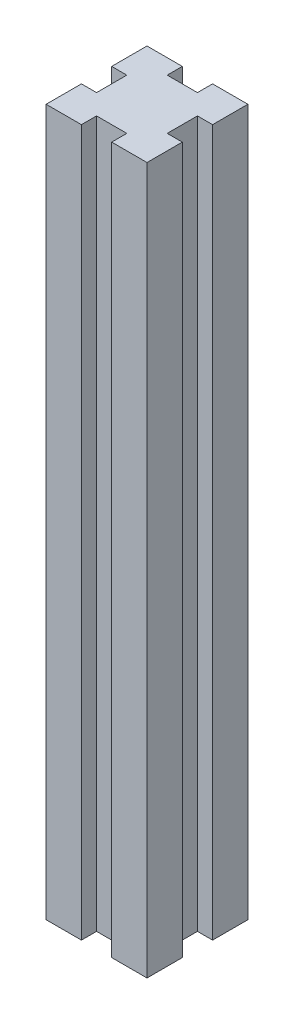
ISO-10303-21;
HEADER;
FILE_DESCRIPTION(('STEP AP214'),'2;1');
FILE_NAME('part.step','',(''),(''),'','','');
FILE_SCHEMA(('AUTOMOTIVE_DESIGN { 1 0 10303 214 1 1 1 1 }'));
ENDSEC;
DATA;
#1=APPLICATION_CONTEXT('core data for automotive mechanical design processes');
#2=APPLICATION_PROTOCOL_DEFINITION('international standard','automotive_design',2000,#1);
#3=PRODUCT_CONTEXT('',#1,'mechanical');
#4=PRODUCT('Part','Part','',(#3));
#5=PRODUCT_RELATED_PRODUCT_CATEGORY('part','',(#4));
#6=PRODUCT_DEFINITION_FORMATION('','',#4);
#7=PRODUCT_DEFINITION_CONTEXT('part definition',#1,'design');
#8=PRODUCT_DEFINITION('design','',#6,#7);
#9=PRODUCT_DEFINITION_SHAPE('','',#8);
#10=(LENGTH_UNIT() NAMED_UNIT(*) SI_UNIT(.MILLI.,.METRE.));
#11=(NAMED_UNIT(*) PLANE_ANGLE_UNIT() SI_UNIT($,.RADIAN.));
#12=(NAMED_UNIT(*) SI_UNIT($,.STERADIAN.) SOLID_ANGLE_UNIT());
#13=UNCERTAINTY_MEASURE_WITH_UNIT(LENGTH_MEASURE(1.E-05),#10,'distance_accuracy_value','');
#14=(GEOMETRIC_REPRESENTATION_CONTEXT(3) GLOBAL_UNCERTAINTY_ASSIGNED_CONTEXT((#13)) GLOBAL_UNIT_ASSIGNED_CONTEXT((#10,
#11,#12)) REPRESENTATION_CONTEXT('',''));
#15=CARTESIAN_POINT('',(0.,0.,0.));
#16=DIRECTION('',(0.,0.,1.));
#17=DIRECTION('',(1.,0.,0.));
#18=AXIS2_PLACEMENT_3D('',#15,#16,#17);
#19=CARTESIAN_POINT('',(-10.,140.,-10.));
#20=DIRECTION('',(1.,0.,0.));
#21=DIRECTION('',(0.,0.,-1.));
#22=AXIS2_PLACEMENT_3D('',#19,#20,#21);
#23=PLANE('',#22);
#24=DIRECTION('',(0.,0.,1.));
#25=VECTOR('',#24,1.);
#26=CARTESIAN_POINT('',(-10.,0.,-10.));
#27=LINE('',#26,#25);
#28=CARTESIAN_POINT('',(-10.,0.,-10.));
#29=VERTEX_POINT('',#28);
#30=CARTESIAN_POINT('',(-10.,0.,-3.));
#31=VERTEX_POINT('',#30);
#32=EDGE_CURVE('E201',#29,#31,#27,.T.);
#33=ORIENTED_EDGE('',*,*,#32,.T.);
#34=DIRECTION('',(0.,-1.,0.));
#35=VECTOR('',#34,1.);
#36=CARTESIAN_POINT('',(-10.,140.,-3.));
#37=LINE('',#36,#35);
#38=CARTESIAN_POINT('',(-10.,140.,-3.));
#39=VERTEX_POINT('',#38);
#40=EDGE_CURVE('E11',#39,#31,#37,.T.);
#41=ORIENTED_EDGE('',*,*,#40,.F.);
#42=DIRECTION('',(0.,0.,1.));
#43=VECTOR('',#42,1.);
#44=CARTESIAN_POINT('',(-10.,140.,-10.));
#45=LINE('',#44,#43);
#46=CARTESIAN_POINT('',(-10.,140.,-10.));
#47=VERTEX_POINT('',#46);
#48=EDGE_CURVE('E239',#47,#39,#45,.T.);
#49=ORIENTED_EDGE('',*,*,#48,.F.);
#50=DIRECTION('',(0.,-1.,0.));
#51=VECTOR('',#50,1.);
#52=CARTESIAN_POINT('',(-10.,140.,-10.));
#53=LINE('',#52,#51);
#54=EDGE_CURVE('E197',#47,#29,#53,.T.);
#55=ORIENTED_EDGE('',*,*,#54,.T.);
#56=EDGE_LOOP('',(#33,#41,#49,#55));
#57=FACE_BOUND('',#56,.T.);
#58=ADVANCED_FACE('F33',(#57),#23,.F.);
#59=CARTESIAN_POINT('',(-10.,140.,-3.));
#60=DIRECTION('',(0.,0.,-1.));
#61=DIRECTION('',(-1.,0.,0.));
#62=AXIS2_PLACEMENT_3D('',#59,#60,#61);
#63=PLANE('',#62);
#64=DIRECTION('',(1.,0.,0.));
#65=VECTOR('',#64,1.);
#66=CARTESIAN_POINT('',(-10.,0.,-3.));
#67=LINE('',#66,#65);
#68=CARTESIAN_POINT('',(-7.,0.,-3.));
#69=VERTEX_POINT('',#68);
#70=EDGE_CURVE('E204',#31,#69,#67,.T.);
#71=ORIENTED_EDGE('',*,*,#70,.T.);
#72=DIRECTION('',(0.,-1.,0.));
#73=VECTOR('',#72,1.);
#74=CARTESIAN_POINT('',(-7.,140.,-3.));
#75=LINE('',#74,#73);
#76=CARTESIAN_POINT('',(-7.,140.,-3.));
#77=VERTEX_POINT('',#76);
#78=EDGE_CURVE('E41',#77,#69,#75,.T.);
#79=ORIENTED_EDGE('',*,*,#78,.F.);
#80=DIRECTION('',(1.,0.,0.));
#81=VECTOR('',#80,1.);
#82=CARTESIAN_POINT('',(-10.,140.,-3.));
#83=LINE('',#82,#81);
#84=EDGE_CURVE('E128',#39,#77,#83,.T.);
#85=ORIENTED_EDGE('',*,*,#84,.F.);
#86=ORIENTED_EDGE('',*,*,#40,.T.);
#87=EDGE_LOOP('',(#71,#79,#85,#86));
#88=FACE_BOUND('',#87,.T.);
#89=ADVANCED_FACE('F357',(#88),#63,.F.);
#90=CARTESIAN_POINT('',(-7.,140.,3.));
#91=DIRECTION('',(1.,0.,0.));
#92=DIRECTION('',(0.,0.,-1.));
#93=AXIS2_PLACEMENT_3D('',#90,#91,#92);
#94=PLANE('',#93);
#95=DIRECTION('',(0.,0.,1.));
#96=VECTOR('',#95,1.);
#97=CARTESIAN_POINT('',(-7.,0.,3.));
#98=LINE('',#97,#96);
#99=CARTESIAN_POINT('',(-7.,0.,3.));
#100=VERTEX_POINT('',#99);
#101=EDGE_CURVE('E206',#69,#100,#98,.T.);
#102=ORIENTED_EDGE('',*,*,#101,.T.);
#103=DIRECTION('',(0.,-1.,0.));
#104=VECTOR('',#103,1.);
#105=CARTESIAN_POINT('',(-7.,140.,3.));
#106=LINE('',#105,#104);
#107=CARTESIAN_POINT('',(-7.,140.,3.));
#108=VERTEX_POINT('',#107);
#109=EDGE_CURVE('E282',#108,#100,#106,.T.);
#110=ORIENTED_EDGE('',*,*,#109,.F.);
#111=DIRECTION('',(0.,0.,1.));
#112=VECTOR('',#111,1.);
#113=CARTESIAN_POINT('',(-7.,140.,3.));
#114=LINE('',#113,#112);
#115=EDGE_CURVE('E290',#77,#108,#114,.T.);
#116=ORIENTED_EDGE('',*,*,#115,.F.);
#117=ORIENTED_EDGE('',*,*,#78,.T.);
#118=EDGE_LOOP('',(#102,#110,#116,#117));
#119=FACE_BOUND('',#118,.T.);
#120=ADVANCED_FACE('F288',(#119),#94,.F.);
#121=CARTESIAN_POINT('',(-10.,140.,3.));
#122=DIRECTION('',(0.,0.,1.));
#123=DIRECTION('',(1.,0.,0.));
#124=AXIS2_PLACEMENT_3D('',#121,#122,#123);
#125=PLANE('',#124);
#126=DIRECTION('',(-1.,0.,0.));
#127=VECTOR('',#126,1.);
#128=CARTESIAN_POINT('',(-10.,0.,3.));
#129=LINE('',#128,#127);
#130=CARTESIAN_POINT('',(-10.,0.,3.));
#131=VERTEX_POINT('',#130);
#132=EDGE_CURVE('E208',#100,#131,#129,.T.);
#133=ORIENTED_EDGE('',*,*,#132,.T.);
#134=DIRECTION('',(0.,-1.,0.));
#135=VECTOR('',#134,1.);
#136=CARTESIAN_POINT('',(-10.,140.,3.));
#137=LINE('',#136,#135);
#138=CARTESIAN_POINT('',(-10.,140.,3.));
#139=VERTEX_POINT('',#138);
#140=EDGE_CURVE('E279',#139,#131,#137,.T.);
#141=ORIENTED_EDGE('',*,*,#140,.F.);
#142=DIRECTION('',(-1.,0.,0.));
#143=VECTOR('',#142,1.);
#144=CARTESIAN_POINT('',(-10.,140.,3.));
#145=LINE('',#144,#143);
#146=EDGE_CURVE('E308',#108,#139,#145,.T.);
#147=ORIENTED_EDGE('',*,*,#146,.F.);
#148=ORIENTED_EDGE('',*,*,#109,.T.);
#149=EDGE_LOOP('',(#133,#141,#147,#148));
#150=FACE_BOUND('',#149,.T.);
#151=ADVANCED_FACE('F299',(#150),#125,.F.);
#152=CARTESIAN_POINT('',(-10.,140.,3.));
#153=DIRECTION('',(1.,0.,0.));
#154=DIRECTION('',(0.,0.,-1.));
#155=AXIS2_PLACEMENT_3D('',#152,#153,#154);
#156=PLANE('',#155);
#157=DIRECTION('',(0.,0.,1.));
#158=VECTOR('',#157,1.);
#159=CARTESIAN_POINT('',(-10.,0.,3.));
#160=LINE('',#159,#158);
#161=CARTESIAN_POINT('',(-10.,0.,10.));
#162=VERTEX_POINT('',#161);
#163=EDGE_CURVE('E210',#131,#162,#160,.T.);
#164=ORIENTED_EDGE('',*,*,#163,.T.);
#165=DIRECTION('',(0.,-1.,0.));
#166=VECTOR('',#165,1.);
#167=CARTESIAN_POINT('',(-10.,140.,10.));
#168=LINE('',#167,#166);
#169=CARTESIAN_POINT('',(-10.,140.,10.));
#170=VERTEX_POINT('',#169);
#171=EDGE_CURVE('E276',#170,#162,#168,.T.);
#172=ORIENTED_EDGE('',*,*,#171,.F.);
#173=DIRECTION('',(0.,0.,1.));
#174=VECTOR('',#173,1.);
#175=CARTESIAN_POINT('',(-10.,140.,3.));
#176=LINE('',#175,#174);
#177=EDGE_CURVE('E305',#139,#170,#176,.T.);
#178=ORIENTED_EDGE('',*,*,#177,.F.);
#179=ORIENTED_EDGE('',*,*,#140,.T.);
#180=EDGE_LOOP('',(#164,#172,#178,#179));
#181=FACE_BOUND('',#180,.T.);
#182=ADVANCED_FACE('F303',(#181),#156,.F.);
#183=CARTESIAN_POINT('',(-10.,140.,10.));
#184=DIRECTION('',(0.,0.,-1.));
#185=DIRECTION('',(-1.,0.,0.));
#186=AXIS2_PLACEMENT_3D('',#183,#184,#185);
#187=PLANE('',#186);
#188=DIRECTION('',(1.,0.,0.));
#189=VECTOR('',#188,1.);
#190=CARTESIAN_POINT('',(-10.,0.,10.));
#191=LINE('',#190,#189);
#192=CARTESIAN_POINT('',(-3.,0.,10.));
#193=VERTEX_POINT('',#192);
#194=EDGE_CURVE('E212',#162,#193,#191,.T.);
#195=ORIENTED_EDGE('',*,*,#194,.T.);
#196=DIRECTION('',(0.,-1.,0.));
#197=VECTOR('',#196,1.);
#198=CARTESIAN_POINT('',(-3.,140.,10.));
#199=LINE('',#198,#197);
#200=CARTESIAN_POINT('',(-3.,140.,10.));
#201=VERTEX_POINT('',#200);
#202=EDGE_CURVE('E273',#201,#193,#199,.T.);
#203=ORIENTED_EDGE('',*,*,#202,.F.);
#204=DIRECTION('',(1.,0.,0.));
#205=VECTOR('',#204,1.);
#206=CARTESIAN_POINT('',(-10.,140.,10.));
#207=LINE('',#206,#205);
#208=EDGE_CURVE('E307',#170,#201,#207,.T.);
#209=ORIENTED_EDGE('',*,*,#208,.F.);
#210=ORIENTED_EDGE('',*,*,#171,.T.);
#211=EDGE_LOOP('',(#195,#203,#209,#210));
#212=FACE_BOUND('',#211,.T.);
#213=ADVANCED_FACE('F370',(#212),#187,.F.);
#214=CARTESIAN_POINT('',(-3.,140.,10.));
#215=DIRECTION('',(-1.,0.,0.));
#216=DIRECTION('',(0.,0.,1.));
#217=AXIS2_PLACEMENT_3D('',#214,#215,#216);
#218=PLANE('',#217);
#219=DIRECTION('',(0.,0.,-1.));
#220=VECTOR('',#219,1.);
#221=CARTESIAN_POINT('',(-3.,0.,10.));
#222=LINE('',#221,#220);
#223=CARTESIAN_POINT('',(-3.,0.,7.));
#224=VERTEX_POINT('',#223);
#225=EDGE_CURVE('E214',#193,#224,#222,.T.);
#226=ORIENTED_EDGE('',*,*,#225,.T.);
#227=DIRECTION('',(0.,-1.,0.));
#228=VECTOR('',#227,1.);
#229=CARTESIAN_POINT('',(-3.,140.,7.));
#230=LINE('',#229,#228);
#231=CARTESIAN_POINT('',(-3.,140.,7.));
#232=VERTEX_POINT('',#231);
#233=EDGE_CURVE('E270',#232,#224,#230,.T.);
#234=ORIENTED_EDGE('',*,*,#233,.F.);
#235=DIRECTION('',(0.,0.,-1.));
#236=VECTOR('',#235,1.);
#237=CARTESIAN_POINT('',(-3.,140.,10.));
#238=LINE('',#237,#236);
#239=EDGE_CURVE('E310',#201,#232,#238,.T.);
#240=ORIENTED_EDGE('',*,*,#239,.F.);
#241=ORIENTED_EDGE('',*,*,#202,.T.);
#242=EDGE_LOOP('',(#226,#234,#240,#241));
#243=FACE_BOUND('',#242,.T.);
#244=ADVANCED_FACE('F373',(#243),#218,.F.);
#245=CARTESIAN_POINT('',(3.,140.,7.));
#246=DIRECTION('',(0.,0.,-1.));
#247=DIRECTION('',(-1.,0.,0.));
#248=AXIS2_PLACEMENT_3D('',#245,#246,#247);
#249=PLANE('',#248);
#250=DIRECTION('',(1.,0.,0.));
#251=VECTOR('',#250,1.);
#252=CARTESIAN_POINT('',(3.,0.,7.));
#253=LINE('',#252,#251);
#254=CARTESIAN_POINT('',(3.,0.,7.));
#255=VERTEX_POINT('',#254);
#256=EDGE_CURVE('E216',#224,#255,#253,.T.);
#257=ORIENTED_EDGE('',*,*,#256,.T.);
#258=DIRECTION('',(0.,-1.,0.));
#259=VECTOR('',#258,1.);
#260=CARTESIAN_POINT('',(3.,140.,7.));
#261=LINE('',#260,#259);
#262=CARTESIAN_POINT('',(3.,140.,7.));
#263=VERTEX_POINT('',#262);
#264=EDGE_CURVE('E267',#263,#255,#261,.T.);
#265=ORIENTED_EDGE('',*,*,#264,.F.);
#266=DIRECTION('',(1.,0.,0.));
#267=VECTOR('',#266,1.);
#268=CARTESIAN_POINT('',(3.,140.,7.));
#269=LINE('',#268,#267);
#270=EDGE_CURVE('E316',#232,#263,#269,.T.);
#271=ORIENTED_EDGE('',*,*,#270,.F.);
#272=ORIENTED_EDGE('',*,*,#233,.T.);
#273=EDGE_LOOP('',(#257,#265,#271,#272));
#274=FACE_BOUND('',#273,.T.);
#275=ADVANCED_FACE('F377',(#274),#249,.F.);
#276=CARTESIAN_POINT('',(3.,140.,10.));
#277=DIRECTION('',(1.,0.,0.));
#278=DIRECTION('',(0.,0.,-1.));
#279=AXIS2_PLACEMENT_3D('',#276,#277,#278);
#280=PLANE('',#279);
#281=DIRECTION('',(0.,0.,1.));
#282=VECTOR('',#281,1.);
#283=CARTESIAN_POINT('',(3.,0.,10.));
#284=LINE('',#283,#282);
#285=CARTESIAN_POINT('',(3.,0.,10.));
#286=VERTEX_POINT('',#285);
#287=EDGE_CURVE('E218',#255,#286,#284,.T.);
#288=ORIENTED_EDGE('',*,*,#287,.T.);
#289=DIRECTION('',(0.,-1.,0.));
#290=VECTOR('',#289,1.);
#291=CARTESIAN_POINT('',(3.,140.,10.));
#292=LINE('',#291,#290);
#293=CARTESIAN_POINT('',(3.,140.,10.));
#294=VERTEX_POINT('',#293);
#295=EDGE_CURVE('E264',#294,#286,#292,.T.);
#296=ORIENTED_EDGE('',*,*,#295,.F.);
#297=DIRECTION('',(0.,0.,1.));
#298=VECTOR('',#297,1.);
#299=CARTESIAN_POINT('',(3.,140.,10.));
#300=LINE('',#299,#298);
#301=EDGE_CURVE('E318',#263,#294,#300,.T.);
#302=ORIENTED_EDGE('',*,*,#301,.F.);
#303=ORIENTED_EDGE('',*,*,#264,.T.);
#304=EDGE_LOOP('',(#288,#296,#302,#303));
#305=FACE_BOUND('',#304,.T.);
#306=ADVANCED_FACE('F381',(#305),#280,.F.);
#307=CARTESIAN_POINT('',(3.,140.,10.));
#308=DIRECTION('',(0.,0.,-1.));
#309=DIRECTION('',(-1.,0.,0.));
#310=AXIS2_PLACEMENT_3D('',#307,#308,#309);
#311=PLANE('',#310);
#312=DIRECTION('',(1.,0.,0.));
#313=VECTOR('',#312,1.);
#314=CARTESIAN_POINT('',(3.,0.,10.));
#315=LINE('',#314,#313);
#316=CARTESIAN_POINT('',(10.,0.,10.));
#317=VERTEX_POINT('',#316);
#318=EDGE_CURVE('E220',#286,#317,#315,.T.);
#319=ORIENTED_EDGE('',*,*,#318,.T.);
#320=DIRECTION('',(0.,-1.,0.));
#321=VECTOR('',#320,1.);
#322=CARTESIAN_POINT('',(10.,140.,10.));
#323=LINE('',#322,#321);
#324=CARTESIAN_POINT('',(10.,140.,10.));
#325=VERTEX_POINT('',#324);
#326=EDGE_CURVE('E261',#325,#317,#323,.T.);
#327=ORIENTED_EDGE('',*,*,#326,.F.);
#328=DIRECTION('',(1.,0.,0.));
#329=VECTOR('',#328,1.);
#330=CARTESIAN_POINT('',(3.,140.,10.));
#331=LINE('',#330,#329);
#332=EDGE_CURVE('E320',#294,#325,#331,.T.);
#333=ORIENTED_EDGE('',*,*,#332,.F.);
#334=ORIENTED_EDGE('',*,*,#295,.T.);
#335=EDGE_LOOP('',(#319,#327,#333,#334));
#336=FACE_BOUND('',#335,.T.);
#337=ADVANCED_FACE('F385',(#336),#311,.F.);
#338=CARTESIAN_POINT('',(10.,140.,3.));
#339=DIRECTION('',(-1.,0.,0.));
#340=DIRECTION('',(0.,0.,1.));
#341=AXIS2_PLACEMENT_3D('',#338,#339,#340);
#342=PLANE('',#341);
#343=DIRECTION('',(0.,0.,-1.));
#344=VECTOR('',#343,1.);
#345=CARTESIAN_POINT('',(10.,0.,3.));
#346=LINE('',#345,#344);
#347=CARTESIAN_POINT('',(10.,0.,3.));
#348=VERTEX_POINT('',#347);
#349=EDGE_CURVE('E222',#317,#348,#346,.T.);
#350=ORIENTED_EDGE('',*,*,#349,.T.);
#351=DIRECTION('',(0.,-1.,0.));
#352=VECTOR('',#351,1.);
#353=CARTESIAN_POINT('',(10.,140.,3.));
#354=LINE('',#353,#352);
#355=CARTESIAN_POINT('',(10.,140.,3.));
#356=VERTEX_POINT('',#355);
#357=EDGE_CURVE('E258',#356,#348,#354,.T.);
#358=ORIENTED_EDGE('',*,*,#357,.F.);
#359=DIRECTION('',(0.,0.,-1.));
#360=VECTOR('',#359,1.);
#361=CARTESIAN_POINT('',(10.,140.,3.));
#362=LINE('',#361,#360);
#363=EDGE_CURVE('E322',#325,#356,#362,.T.);
#364=ORIENTED_EDGE('',*,*,#363,.F.);
#365=ORIENTED_EDGE('',*,*,#326,.T.);
#366=EDGE_LOOP('',(#350,#358,#364,#365));
#367=FACE_BOUND('',#366,.T.);
#368=ADVANCED_FACE('F389',(#367),#342,.F.);
#369=CARTESIAN_POINT('',(10.,140.,3.));
#370=DIRECTION('',(0.,0.,1.));
#371=DIRECTION('',(1.,0.,0.));
#372=AXIS2_PLACEMENT_3D('',#369,#370,#371);
#373=PLANE('',#372);
#374=DIRECTION('',(-1.,0.,0.));
#375=VECTOR('',#374,1.);
#376=CARTESIAN_POINT('',(10.,0.,3.));
#377=LINE('',#376,#375);
#378=CARTESIAN_POINT('',(7.,0.,3.));
#379=VERTEX_POINT('',#378);
#380=EDGE_CURVE('E224',#348,#379,#377,.T.);
#381=ORIENTED_EDGE('',*,*,#380,.T.);
#382=DIRECTION('',(0.,-1.,0.));
#383=VECTOR('',#382,1.);
#384=CARTESIAN_POINT('',(7.,140.,3.));
#385=LINE('',#384,#383);
#386=CARTESIAN_POINT('',(7.,140.,3.));
#387=VERTEX_POINT('',#386);
#388=EDGE_CURVE('E255',#387,#379,#385,.T.);
#389=ORIENTED_EDGE('',*,*,#388,.F.);
#390=DIRECTION('',(-1.,0.,0.));
#391=VECTOR('',#390,1.);
#392=CARTESIAN_POINT('',(10.,140.,3.));
#393=LINE('',#392,#391);
#394=EDGE_CURVE('E324',#356,#387,#393,.T.);
#395=ORIENTED_EDGE('',*,*,#394,.F.);
#396=ORIENTED_EDGE('',*,*,#357,.T.);
#397=EDGE_LOOP('',(#381,#389,#395,#396));
#398=FACE_BOUND('',#397,.T.);
#399=ADVANCED_FACE('F393',(#398),#373,.F.);
#400=CARTESIAN_POINT('',(7.,140.,-3.));
#401=DIRECTION('',(-1.,0.,0.));
#402=DIRECTION('',(0.,0.,1.));
#403=AXIS2_PLACEMENT_3D('',#400,#401,#402);
#404=PLANE('',#403);
#405=DIRECTION('',(0.,0.,-1.));
#406=VECTOR('',#405,1.);
#407=CARTESIAN_POINT('',(7.,0.,-3.));
#408=LINE('',#407,#406);
#409=CARTESIAN_POINT('',(7.,0.,-3.));
#410=VERTEX_POINT('',#409);
#411=EDGE_CURVE('E226',#379,#410,#408,.T.);
#412=ORIENTED_EDGE('',*,*,#411,.T.);
#413=DIRECTION('',(0.,-1.,0.));
#414=VECTOR('',#413,1.);
#415=CARTESIAN_POINT('',(7.,140.,-3.));
#416=LINE('',#415,#414);
#417=CARTESIAN_POINT('',(7.,140.,-3.));
#418=VERTEX_POINT('',#417);
#419=EDGE_CURVE('E252',#418,#410,#416,.T.);
#420=ORIENTED_EDGE('',*,*,#419,.F.);
#421=DIRECTION('',(0.,0.,-1.));
#422=VECTOR('',#421,1.);
#423=CARTESIAN_POINT('',(7.,140.,-3.));
#424=LINE('',#423,#422);
#425=EDGE_CURVE('E326',#387,#418,#424,.T.);
#426=ORIENTED_EDGE('',*,*,#425,.F.);
#427=ORIENTED_EDGE('',*,*,#388,.T.);
#428=EDGE_LOOP('',(#412,#420,#426,#427));
#429=FACE_BOUND('',#428,.T.);
#430=ADVANCED_FACE('F397',(#429),#404,.F.);
#431=CARTESIAN_POINT('',(10.,140.,-3.));
#432=DIRECTION('',(0.,0.,-1.));
#433=DIRECTION('',(-1.,0.,0.));
#434=AXIS2_PLACEMENT_3D('',#431,#432,#433);
#435=PLANE('',#434);
#436=DIRECTION('',(1.,0.,0.));
#437=VECTOR('',#436,1.);
#438=CARTESIAN_POINT('',(10.,0.,-3.));
#439=LINE('',#438,#437);
#440=CARTESIAN_POINT('',(10.,0.,-3.));
#441=VERTEX_POINT('',#440);
#442=EDGE_CURVE('E228',#410,#441,#439,.T.);
#443=ORIENTED_EDGE('',*,*,#442,.T.);
#444=DIRECTION('',(0.,-1.,0.));
#445=VECTOR('',#444,1.);
#446=CARTESIAN_POINT('',(10.,140.,-3.));
#447=LINE('',#446,#445);
#448=CARTESIAN_POINT('',(10.,140.,-3.));
#449=VERTEX_POINT('',#448);
#450=EDGE_CURVE('E249',#449,#441,#447,.T.);
#451=ORIENTED_EDGE('',*,*,#450,.F.);
#452=DIRECTION('',(1.,0.,0.));
#453=VECTOR('',#452,1.);
#454=CARTESIAN_POINT('',(10.,140.,-3.));
#455=LINE('',#454,#453);
#456=EDGE_CURVE('E328',#418,#449,#455,.T.);
#457=ORIENTED_EDGE('',*,*,#456,.F.);
#458=ORIENTED_EDGE('',*,*,#419,.T.);
#459=EDGE_LOOP('',(#443,#451,#457,#458));
#460=FACE_BOUND('',#459,.T.);
#461=ADVANCED_FACE('F401',(#460),#435,.F.);
#462=CARTESIAN_POINT('',(10.,140.,-10.));
#463=DIRECTION('',(-1.,0.,0.));
#464=DIRECTION('',(0.,0.,1.));
#465=AXIS2_PLACEMENT_3D('',#462,#463,#464);
#466=PLANE('',#465);
#467=DIRECTION('',(0.,0.,-1.));
#468=VECTOR('',#467,1.);
#469=CARTESIAN_POINT('',(10.,0.,-10.));
#470=LINE('',#469,#468);
#471=CARTESIAN_POINT('',(10.,0.,-10.));
#472=VERTEX_POINT('',#471);
#473=EDGE_CURVE('E230',#441,#472,#470,.T.);
#474=ORIENTED_EDGE('',*,*,#473,.T.);
#475=DIRECTION('',(0.,-1.,0.));
#476=VECTOR('',#475,1.);
#477=CARTESIAN_POINT('',(10.,140.,-10.));
#478=LINE('',#477,#476);
#479=CARTESIAN_POINT('',(10.,140.,-10.));
#480=VERTEX_POINT('',#479);
#481=EDGE_CURVE('E246',#480,#472,#478,.T.);
#482=ORIENTED_EDGE('',*,*,#481,.F.);
#483=DIRECTION('',(0.,0.,-1.));
#484=VECTOR('',#483,1.);
#485=CARTESIAN_POINT('',(10.,140.,-10.));
#486=LINE('',#485,#484);
#487=EDGE_CURVE('E330',#449,#480,#486,.T.);
#488=ORIENTED_EDGE('',*,*,#487,.F.);
#489=ORIENTED_EDGE('',*,*,#450,.T.);
#490=EDGE_LOOP('',(#474,#482,#488,#489));
#491=FACE_BOUND('',#490,.T.);
#492=ADVANCED_FACE('F405',(#491),#466,.F.);
#493=CARTESIAN_POINT('',(3.,140.,-10.));
#494=DIRECTION('',(0.,0.,1.));
#495=DIRECTION('',(1.,0.,0.));
#496=AXIS2_PLACEMENT_3D('',#493,#494,#495);
#497=PLANE('',#496);
#498=DIRECTION('',(-1.,0.,0.));
#499=VECTOR('',#498,1.);
#500=CARTESIAN_POINT('',(3.,0.,-10.));
#501=LINE('',#500,#499);
#502=CARTESIAN_POINT('',(3.,0.,-10.));
#503=VERTEX_POINT('',#502);
#504=EDGE_CURVE('E232',#472,#503,#501,.T.);
#505=ORIENTED_EDGE('',*,*,#504,.T.);
#506=DIRECTION('',(0.,-1.,0.));
#507=VECTOR('',#506,1.);
#508=CARTESIAN_POINT('',(3.,140.,-10.));
#509=LINE('',#508,#507);
#510=CARTESIAN_POINT('',(3.,140.,-10.));
#511=VERTEX_POINT('',#510);
#512=EDGE_CURVE('E243',#511,#503,#509,.T.);
#513=ORIENTED_EDGE('',*,*,#512,.F.);
#514=DIRECTION('',(-1.,0.,0.));
#515=VECTOR('',#514,1.);
#516=CARTESIAN_POINT('',(3.,140.,-10.));
#517=LINE('',#516,#515);
#518=EDGE_CURVE('E332',#480,#511,#517,.T.);
#519=ORIENTED_EDGE('',*,*,#518,.F.);
#520=ORIENTED_EDGE('',*,*,#481,.T.);
#521=EDGE_LOOP('',(#505,#513,#519,#520));
#522=FACE_BOUND('',#521,.T.);
#523=ADVANCED_FACE('F338',(#522),#497,.F.);
#524=CARTESIAN_POINT('',(3.,140.,-10.));
#525=DIRECTION('',(1.,0.,0.));
#526=DIRECTION('',(0.,0.,-1.));
#527=AXIS2_PLACEMENT_3D('',#524,#525,#526);
#528=PLANE('',#527);
#529=DIRECTION('',(0.,0.,1.));
#530=VECTOR('',#529,1.);
#531=CARTESIAN_POINT('',(3.,0.,-10.));
#532=LINE('',#531,#530);
#533=CARTESIAN_POINT('',(3.,0.,-7.));
#534=VERTEX_POINT('',#533);
#535=EDGE_CURVE('E234',#503,#534,#532,.T.);
#536=ORIENTED_EDGE('',*,*,#535,.T.);
#537=DIRECTION('',(0.,-1.,0.));
#538=VECTOR('',#537,1.);
#539=CARTESIAN_POINT('',(3.,140.,-7.));
#540=LINE('',#539,#538);
#541=CARTESIAN_POINT('',(3.,140.,-7.));
#542=VERTEX_POINT('',#541);
#543=EDGE_CURVE('E192',#542,#534,#540,.T.);
#544=ORIENTED_EDGE('',*,*,#543,.F.);
#545=DIRECTION('',(0.,0.,1.));
#546=VECTOR('',#545,1.);
#547=CARTESIAN_POINT('',(3.,140.,-10.));
#548=LINE('',#547,#546);
#549=EDGE_CURVE('E183',#511,#542,#548,.T.);
#550=ORIENTED_EDGE('',*,*,#549,.F.);
#551=ORIENTED_EDGE('',*,*,#512,.T.);
#552=EDGE_LOOP('',(#536,#544,#550,#551));
#553=FACE_BOUND('',#552,.T.);
#554=ADVANCED_FACE('F342',(#553),#528,.F.);
#555=CARTESIAN_POINT('',(-3.,140.,-7.));
#556=DIRECTION('',(0.,0.,1.));
#557=DIRECTION('',(1.,0.,0.));
#558=AXIS2_PLACEMENT_3D('',#555,#556,#557);
#559=PLANE('',#558);
#560=DIRECTION('',(-1.,0.,0.));
#561=VECTOR('',#560,1.);
#562=CARTESIAN_POINT('',(-3.,0.,-7.));
#563=LINE('',#562,#561);
#564=CARTESIAN_POINT('',(-3.,0.,-7.));
#565=VERTEX_POINT('',#564);
#566=EDGE_CURVE('E191',#534,#565,#563,.T.);
#567=ORIENTED_EDGE('',*,*,#566,.T.);
#568=DIRECTION('',(0.,-1.,0.));
#569=VECTOR('',#568,1.);
#570=CARTESIAN_POINT('',(-3.,140.,-7.));
#571=LINE('',#570,#569);
#572=CARTESIAN_POINT('',(-3.,140.,-7.));
#573=VERTEX_POINT('',#572);
#574=EDGE_CURVE('E188',#573,#565,#571,.T.);
#575=ORIENTED_EDGE('',*,*,#574,.F.);
#576=DIRECTION('',(-1.,0.,0.));
#577=VECTOR('',#576,1.);
#578=CARTESIAN_POINT('',(-3.,140.,-7.));
#579=LINE('',#578,#577);
#580=EDGE_CURVE('E177',#542,#573,#579,.T.);
#581=ORIENTED_EDGE('',*,*,#580,.F.);
#582=ORIENTED_EDGE('',*,*,#543,.T.);
#583=EDGE_LOOP('',(#567,#575,#581,#582));
#584=FACE_BOUND('',#583,.T.);
#585=ADVANCED_FACE('F189',(#584),#559,.F.);
#586=CARTESIAN_POINT('',(-3.,140.,-10.));
#587=DIRECTION('',(-1.,0.,0.));
#588=DIRECTION('',(0.,0.,1.));
#589=AXIS2_PLACEMENT_3D('',#586,#587,#588);
#590=PLANE('',#589);
#591=DIRECTION('',(0.,0.,-1.));
#592=VECTOR('',#591,1.);
#593=CARTESIAN_POINT('',(-3.,0.,-10.));
#594=LINE('',#593,#592);
#595=CARTESIAN_POINT('',(-3.,0.,-10.));
#596=VERTEX_POINT('',#595);
#597=EDGE_CURVE('E114',#565,#596,#594,.T.);
#598=ORIENTED_EDGE('',*,*,#597,.T.);
#599=DIRECTION('',(0.,-1.,0.));
#600=VECTOR('',#599,1.);
#601=CARTESIAN_POINT('',(-3.,140.,-10.));
#602=LINE('',#601,#600);
#603=CARTESIAN_POINT('',(-3.,140.,-10.));
#604=VERTEX_POINT('',#603);
#605=EDGE_CURVE('E193',#604,#596,#602,.T.);
#606=ORIENTED_EDGE('',*,*,#605,.F.);
#607=DIRECTION('',(0.,0.,-1.));
#608=VECTOR('',#607,1.);
#609=CARTESIAN_POINT('',(-3.,140.,-10.));
#610=LINE('',#609,#608);
#611=EDGE_CURVE('E181',#573,#604,#610,.T.);
#612=ORIENTED_EDGE('',*,*,#611,.F.);
#613=ORIENTED_EDGE('',*,*,#574,.T.);
#614=EDGE_LOOP('',(#598,#606,#612,#613));
#615=FACE_BOUND('',#614,.T.);
#616=ADVANCED_FACE('F195',(#615),#590,.F.);
#617=CARTESIAN_POINT('',(-10.,140.,-10.));
#618=DIRECTION('',(0.,0.,1.));
#619=DIRECTION('',(1.,0.,0.));
#620=AXIS2_PLACEMENT_3D('',#617,#618,#619);
#621=PLANE('',#620);
#622=DIRECTION('',(-1.,0.,0.));
#623=VECTOR('',#622,1.);
#624=CARTESIAN_POINT('',(-10.,0.,-10.));
#625=LINE('',#624,#623);
#626=EDGE_CURVE('E120',#596,#29,#625,.T.);
#627=ORIENTED_EDGE('',*,*,#626,.T.);
#628=ORIENTED_EDGE('',*,*,#54,.F.);
#629=DIRECTION('',(-1.,0.,0.));
#630=VECTOR('',#629,1.);
#631=CARTESIAN_POINT('',(-10.,140.,-10.));
#632=LINE('',#631,#630);
#633=EDGE_CURVE('E49',#604,#47,#632,.T.);
#634=ORIENTED_EDGE('',*,*,#633,.F.);
#635=ORIENTED_EDGE('',*,*,#605,.T.);
#636=EDGE_LOOP('',(#627,#628,#634,#635));
#637=FACE_BOUND('',#636,.T.);
#638=ADVANCED_FACE('F346',(#637),#621,.F.);
#639=CARTESIAN_POINT('',(0.,140.,0.));
#640=DIRECTION('',(0.,1.,0.));
#641=DIRECTION('',(0.,0.,1.));
#642=AXIS2_PLACEMENT_3D('',#639,#640,#641);
#643=PLANE('',#642);
#644=ORIENTED_EDGE('',*,*,#48,.T.);
#645=ORIENTED_EDGE('',*,*,#84,.T.);
#646=ORIENTED_EDGE('',*,*,#115,.T.);
#647=ORIENTED_EDGE('',*,*,#146,.T.);
#648=ORIENTED_EDGE('',*,*,#177,.T.);
#649=ORIENTED_EDGE('',*,*,#208,.T.);
#650=ORIENTED_EDGE('',*,*,#239,.T.);
#651=ORIENTED_EDGE('',*,*,#270,.T.);
#652=ORIENTED_EDGE('',*,*,#301,.T.);
#653=ORIENTED_EDGE('',*,*,#332,.T.);
#654=ORIENTED_EDGE('',*,*,#363,.T.);
#655=ORIENTED_EDGE('',*,*,#394,.T.);
#656=ORIENTED_EDGE('',*,*,#425,.T.);
#657=ORIENTED_EDGE('',*,*,#456,.T.);
#658=ORIENTED_EDGE('',*,*,#487,.T.);
#659=ORIENTED_EDGE('',*,*,#518,.T.);
#660=ORIENTED_EDGE('',*,*,#549,.T.);
#661=ORIENTED_EDGE('',*,*,#580,.T.);
#662=ORIENTED_EDGE('',*,*,#611,.T.);
#663=ORIENTED_EDGE('',*,*,#633,.T.);
#664=EDGE_LOOP('',(#644,#645,#646,#647,#648,#649,#650,#651,#652,#653,#654,#655,#656,#657,#658,
#659,#660,#661,#662,#663));
#665=FACE_BOUND('',#664,.T.);
#666=ADVANCED_FACE('F179',(#665),#643,.T.);
#667=CARTESIAN_POINT('',(0.,0.,0.));
#668=DIRECTION('',(0.,1.,0.));
#669=DIRECTION('',(0.,0.,1.));
#670=AXIS2_PLACEMENT_3D('',#667,#668,#669);
#671=PLANE('',#670);
#672=ORIENTED_EDGE('',*,*,#32,.F.);
#673=ORIENTED_EDGE('',*,*,#626,.F.);
#674=ORIENTED_EDGE('',*,*,#597,.F.);
#675=ORIENTED_EDGE('',*,*,#566,.F.);
#676=ORIENTED_EDGE('',*,*,#535,.F.);
#677=ORIENTED_EDGE('',*,*,#504,.F.);
#678=ORIENTED_EDGE('',*,*,#473,.F.);
#679=ORIENTED_EDGE('',*,*,#442,.F.);
#680=ORIENTED_EDGE('',*,*,#411,.F.);
#681=ORIENTED_EDGE('',*,*,#380,.F.);
#682=ORIENTED_EDGE('',*,*,#349,.F.);
#683=ORIENTED_EDGE('',*,*,#318,.F.);
#684=ORIENTED_EDGE('',*,*,#287,.F.);
#685=ORIENTED_EDGE('',*,*,#256,.F.);
#686=ORIENTED_EDGE('',*,*,#225,.F.);
#687=ORIENTED_EDGE('',*,*,#194,.F.);
#688=ORIENTED_EDGE('',*,*,#163,.F.);
#689=ORIENTED_EDGE('',*,*,#132,.F.);
#690=ORIENTED_EDGE('',*,*,#101,.F.);
#691=ORIENTED_EDGE('',*,*,#70,.F.);
#692=EDGE_LOOP('',(#672,#673,#674,#675,#676,#677,#678,#679,#680,#681,#682,#683,#684,#685,#686,
#687,#688,#689,#690,#691));
#693=FACE_BOUND('',#692,.T.);
#694=ADVANCED_FACE('F294',(#693),#671,.F.);
#695=CLOSED_SHELL('',(#58,#89,#120,#151,#182,#213,#244,#275,#306,#337,#368,#399,#430,#461,#492,
#523,#554,#585,#616,#638,#666,#694));
#696=MANIFOLD_SOLID_BREP('B2',#695);
#697=ADVANCED_BREP_SHAPE_REPRESENTATION('',(#18,#696),#14);
#698=SHAPE_DEFINITION_REPRESENTATION(#9,#697);
ENDSEC;
END-ISO-10303-21;
